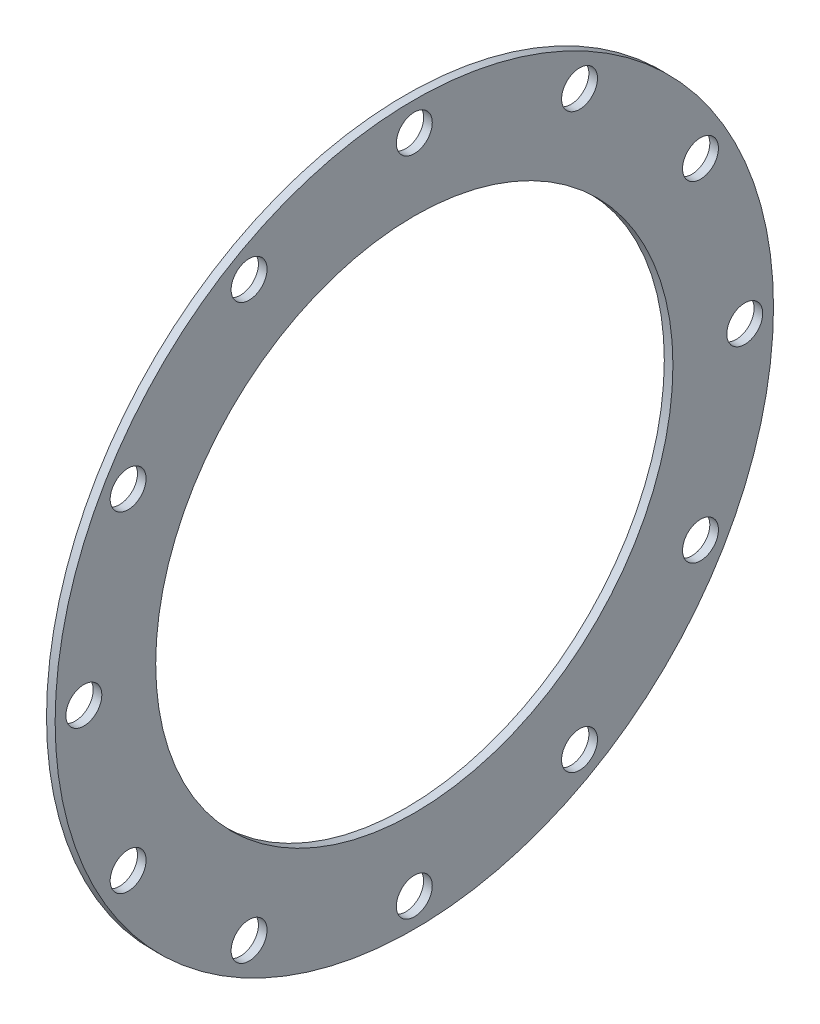
ISO-10303-21;
HEADER;
FILE_DESCRIPTION(('STEP AP214'),'2;1');
FILE_NAME('part.step','',(''),(''),'','','');
FILE_SCHEMA(('AUTOMOTIVE_DESIGN { 1 0 10303 214 1 1 1 1 }'));
ENDSEC;
DATA;
#1=APPLICATION_CONTEXT('core data for automotive mechanical design processes');
#2=APPLICATION_PROTOCOL_DEFINITION('international standard','automotive_design',2000,#1);
#3=PRODUCT_CONTEXT('',#1,'mechanical');
#4=PRODUCT('Part','Part','',(#3));
#5=PRODUCT_RELATED_PRODUCT_CATEGORY('part','',(#4));
#6=PRODUCT_DEFINITION_FORMATION('','',#4);
#7=PRODUCT_DEFINITION_CONTEXT('part definition',#1,'design');
#8=PRODUCT_DEFINITION('design','',#6,#7);
#9=PRODUCT_DEFINITION_SHAPE('','',#8);
#10=(LENGTH_UNIT() NAMED_UNIT(*) SI_UNIT(.MILLI.,.METRE.));
#11=(NAMED_UNIT(*) PLANE_ANGLE_UNIT() SI_UNIT($,.RADIAN.));
#12=(NAMED_UNIT(*) SI_UNIT($,.STERADIAN.) SOLID_ANGLE_UNIT());
#13=UNCERTAINTY_MEASURE_WITH_UNIT(LENGTH_MEASURE(1.E-05),#10,'distance_accuracy_value','');
#14=(GEOMETRIC_REPRESENTATION_CONTEXT(3) GLOBAL_UNCERTAINTY_ASSIGNED_CONTEXT((#13)) GLOBAL_UNIT_ASSIGNED_CONTEXT((#10,
#11,#12)) REPRESENTATION_CONTEXT('',''));
#15=CARTESIAN_POINT('',(0.,0.,0.));
#16=DIRECTION('',(0.,0.,1.));
#17=DIRECTION('',(1.,0.,0.));
#18=AXIS2_PLACEMENT_3D('',#15,#16,#17);
#19=CARTESIAN_POINT('',(60.,0.,0.));
#20=DIRECTION('',(1.,0.,0.));
#21=DIRECTION('',(0.,0.,-1.));
#22=AXIS2_PLACEMENT_3D('',#19,#20,#21);
#23=PLANE('',#22);
#24=CARTESIAN_POINT('',(60.,0.,0.));
#25=DIRECTION('',(1.,0.,0.));
#26=DIRECTION('',(0.,0.,-1.));
#27=AXIS2_PLACEMENT_3D('',#24,#25,#26);
#28=CIRCLE('',#27,1800.);
#29=CARTESIAN_POINT('',(60.,0.,-1800.));
#30=VERTEX_POINT('',#29);
#31=EDGE_CURVE('E148',#30,#30,#28,.T.);
#32=ORIENTED_EDGE('',*,*,#31,.F.);
#33=EDGE_LOOP('',(#32));
#34=FACE_BOUND('',#33,.T.);
#35=CARTESIAN_POINT('',(60.,1149.99999999991,1991.85842870416));
#36=DIRECTION('',(1.,0.,0.));
#37=DIRECTION('',(0.,0.,-1.));
#38=AXIS2_PLACEMENT_3D('',#35,#36,#37);
#39=CIRCLE('',#38,125.000000000099);
#40=CARTESIAN_POINT('',(60.,1149.99999999991,1866.85842870406));
#41=VERTEX_POINT('',#40);
#42=EDGE_CURVE('E128',#41,#41,#39,.T.);
#43=ORIENTED_EDGE('',*,*,#42,.F.);
#44=EDGE_LOOP('',(#43));
#45=FACE_BOUND('',#44,.T.);
#46=CARTESIAN_POINT('',(60.,-1150.00000000009,1991.85842870406));
#47=DIRECTION('',(1.,0.,0.));
#48=DIRECTION('',(0.,0.,-1.));
#49=AXIS2_PLACEMENT_3D('',#46,#47,#48);
#50=CIRCLE('',#49,125.000000000186);
#51=CARTESIAN_POINT('',(60.,-1150.00000000009,1866.85842870388));
#52=VERTEX_POINT('',#51);
#53=EDGE_CURVE('E112',#52,#52,#50,.T.);
#54=ORIENTED_EDGE('',*,*,#53,.F.);
#55=EDGE_LOOP('',(#54));
#56=FACE_BOUND('',#55,.T.);
#57=CARTESIAN_POINT('',(60.,-2300.,-1.95264788778376E-10));
#58=DIRECTION('',(1.,0.,0.));
#59=DIRECTION('',(0.,0.,-1.));
#60=AXIS2_PLACEMENT_3D('',#57,#58,#59);
#61=CIRCLE('',#60,125.000000000202);
#62=CARTESIAN_POINT('',(60.,-2300.,-125.000000000397));
#63=VERTEX_POINT('',#62);
#64=EDGE_CURVE('E96',#63,#63,#61,.T.);
#65=ORIENTED_EDGE('',*,*,#64,.F.);
#66=EDGE_LOOP('',(#65));
#67=FACE_BOUND('',#66,.T.);
#68=CARTESIAN_POINT('',(60.,-1149.99999999992,-1991.85842870436));
#69=DIRECTION('',(1.,0.,0.));
#70=DIRECTION('',(0.,0.,-1.));
#71=AXIS2_PLACEMENT_3D('',#68,#69,#70);
#72=CIRCLE('',#71,125.000000000126);
#73=CARTESIAN_POINT('',(60.,-1149.99999999992,-2116.85842870448));
#74=VERTEX_POINT('',#73);
#75=EDGE_CURVE('E80',#74,#74,#72,.T.);
#76=ORIENTED_EDGE('',*,*,#75,.F.);
#77=EDGE_LOOP('',(#76));
#78=FACE_BOUND('',#77,.T.);
#79=CARTESIAN_POINT('',(60.,1150.00000000008,-1991.85842870426));
#80=DIRECTION('',(1.,0.,0.));
#81=DIRECTION('',(0.,0.,-1.));
#82=AXIS2_PLACEMENT_3D('',#79,#80,#81);
#83=CIRCLE('',#82,125.000000000027);
#84=CARTESIAN_POINT('',(60.,1150.00000000008,-2116.85842870428));
#85=VERTEX_POINT('',#84);
#86=EDGE_CURVE('E64',#85,#85,#83,.T.);
#87=ORIENTED_EDGE('',*,*,#86,.F.);
#88=EDGE_LOOP('',(#87));
#89=FACE_BOUND('',#88,.T.);
#90=CARTESIAN_POINT('',(60.,2300.,0.));
#91=DIRECTION('',(1.,0.,0.));
#92=DIRECTION('',(0.,0.,-1.));
#93=AXIS2_PLACEMENT_3D('',#90,#91,#92);
#94=CIRCLE('',#93,125.);
#95=CARTESIAN_POINT('',(60.,2300.,-125.));
#96=VERTEX_POINT('',#95);
#97=EDGE_CURVE('E50',#96,#96,#94,.T.);
#98=ORIENTED_EDGE('',*,*,#97,.F.);
#99=EDGE_LOOP('',(#98));
#100=FACE_BOUND('',#99,.T.);
#101=CARTESIAN_POINT('',(60.,0.,0.));
#102=DIRECTION('',(1.,0.,0.));
#103=DIRECTION('',(0.,0.,-1.));
#104=AXIS2_PLACEMENT_3D('',#101,#102,#103);
#105=CIRCLE('',#104,2500.);
#106=CARTESIAN_POINT('',(60.,0.,-2500.));
#107=VERTEX_POINT('',#106);
#108=EDGE_CURVE('E10',#107,#107,#105,.T.);
#109=ORIENTED_EDGE('',*,*,#108,.T.);
#110=EDGE_LOOP('',(#109));
#111=FACE_BOUND('',#110,.T.);
#112=CARTESIAN_POINT('',(60.,1991.85842870421,-1150.));
#113=DIRECTION('',(1.,0.,0.));
#114=DIRECTION('',(0.,0.,-1.));
#115=AXIS2_PLACEMENT_3D('',#112,#113,#114);
#116=CIRCLE('',#115,125.);
#117=CARTESIAN_POINT('',(60.,1991.85842870421,-1275.));
#118=VERTEX_POINT('',#117);
#119=EDGE_CURVE('E56',#118,#118,#116,.T.);
#120=ORIENTED_EDGE('',*,*,#119,.F.);
#121=EDGE_LOOP('',(#120));
#122=FACE_BOUND('',#121,.T.);
#123=CARTESIAN_POINT('',(60.,9.7632394389188E-11,-2300.0000000001));
#124=DIRECTION('',(1.,0.,0.));
#125=DIRECTION('',(0.,0.,-1.));
#126=AXIS2_PLACEMENT_3D('',#123,#124,#125);
#127=CIRCLE('',#126,125.000000000072);
#128=CARTESIAN_POINT('',(60.,9.7632394389188E-11,-2425.00000000017));
#129=VERTEX_POINT('',#128);
#130=EDGE_CURVE('E72',#129,#129,#127,.T.);
#131=ORIENTED_EDGE('',*,*,#130,.F.);
#132=EDGE_LOOP('',(#131));
#133=FACE_BOUND('',#132,.T.);
#134=CARTESIAN_POINT('',(60.,-1991.85842870416,-1150.00000000018));
#135=DIRECTION('',(1.,0.,0.));
#136=DIRECTION('',(0.,0.,-1.));
#137=AXIS2_PLACEMENT_3D('',#134,#135,#136);
#138=CIRCLE('',#137,125.000000000173);
#139=CARTESIAN_POINT('',(60.,-1991.85842870416,-1275.00000000036));
#140=VERTEX_POINT('',#139);
#141=EDGE_CURVE('E88',#140,#140,#138,.T.);
#142=ORIENTED_EDGE('',*,*,#141,.F.);
#143=EDGE_LOOP('',(#142));
#144=FACE_BOUND('',#143,.T.);
#145=CARTESIAN_POINT('',(60.,-1991.85842870426,1149.99999999982));
#146=DIRECTION('',(1.,0.,0.));
#147=DIRECTION('',(0.,0.,-1.));
#148=AXIS2_PLACEMENT_3D('',#145,#146,#147);
#149=CIRCLE('',#148,125.000000000208);
#150=CARTESIAN_POINT('',(60.,-1991.85842870426,1024.99999999961));
#151=VERTEX_POINT('',#150);
#152=EDGE_CURVE('E104',#151,#151,#149,.T.);
#153=ORIENTED_EDGE('',*,*,#152,.F.);
#154=EDGE_LOOP('',(#153));
#155=FACE_BOUND('',#154,.T.);
#156=CARTESIAN_POINT('',(60.,-9.79140631529919E-11,2299.9999999999));
#157=DIRECTION('',(1.,0.,0.));
#158=DIRECTION('',(0.,0.,-1.));
#159=AXIS2_PLACEMENT_3D('',#156,#157,#158);
#160=CIRCLE('',#159,125.000000000145);
#161=CARTESIAN_POINT('',(60.,-9.79140631529919E-11,2174.99999999976));
#162=VERTEX_POINT('',#161);
#163=EDGE_CURVE('E120',#162,#162,#160,.T.);
#164=ORIENTED_EDGE('',*,*,#163,.F.);
#165=EDGE_LOOP('',(#164));
#166=FACE_BOUND('',#165,.T.);
#167=CARTESIAN_POINT('',(60.,1991.85842870416,1149.99999999999));
#168=DIRECTION('',(1.,0.,0.));
#169=DIRECTION('',(0.,0.,-1.));
#170=AXIS2_PLACEMENT_3D('',#167,#168,#169);
#171=CIRCLE('',#170,125.000000000056);
#172=CARTESIAN_POINT('',(60.,1991.85842870416,1024.99999999993));
#173=VERTEX_POINT('',#172);
#174=EDGE_CURVE('E136',#173,#173,#171,.T.);
#175=ORIENTED_EDGE('',*,*,#174,.F.);
#176=EDGE_LOOP('',(#175));
#177=FACE_BOUND('',#176,.T.);
#178=ADVANCED_FACE('F37',(#34,#45,#56,#67,#78,#89,#100,#111,#122,#133,#144,#155,#166,#177),#23,.T.);
#179=CARTESIAN_POINT('',(0.,0.,0.));
#180=DIRECTION('',(1.,0.,0.));
#181=DIRECTION('',(0.,0.,-1.));
#182=AXIS2_PLACEMENT_3D('',#179,#180,#181);
#183=PLANE('',#182);
#184=CARTESIAN_POINT('',(0.,0.,0.));
#185=DIRECTION('',(1.,0.,0.));
#186=DIRECTION('',(0.,0.,-1.));
#187=AXIS2_PLACEMENT_3D('',#184,#185,#186);
#188=CIRCLE('',#187,1800.);
#189=CARTESIAN_POINT('',(0.,0.,-1800.));
#190=VERTEX_POINT('',#189);
#191=EDGE_CURVE('E144',#190,#190,#188,.T.);
#192=ORIENTED_EDGE('',*,*,#191,.T.);
#193=EDGE_LOOP('',(#192));
#194=FACE_BOUND('',#193,.T.);
#195=CARTESIAN_POINT('',(0.,0.,0.));
#196=DIRECTION('',(1.,0.,0.));
#197=DIRECTION('',(0.,0.,-1.));
#198=AXIS2_PLACEMENT_3D('',#195,#196,#197);
#199=CIRCLE('',#198,2500.);
#200=CARTESIAN_POINT('',(0.,0.,-2500.));
#201=VERTEX_POINT('',#200);
#202=EDGE_CURVE('E41',#201,#201,#199,.T.);
#203=ORIENTED_EDGE('',*,*,#202,.F.);
#204=EDGE_LOOP('',(#203));
#205=FACE_BOUND('',#204,.T.);
#206=CARTESIAN_POINT('',(0.,2300.,0.));
#207=DIRECTION('',(1.,0.,0.));
#208=DIRECTION('',(0.,0.,-1.));
#209=AXIS2_PLACEMENT_3D('',#206,#207,#208);
#210=CIRCLE('',#209,125.);
#211=CARTESIAN_POINT('',(0.,2300.,-125.));
#212=VERTEX_POINT('',#211);
#213=EDGE_CURVE('E52',#212,#212,#210,.T.);
#214=ORIENTED_EDGE('',*,*,#213,.T.);
#215=EDGE_LOOP('',(#214));
#216=FACE_BOUND('',#215,.T.);
#217=CARTESIAN_POINT('',(0.,1991.85842870421,-1150.));
#218=DIRECTION('',(1.,0.,0.));
#219=DIRECTION('',(0.,0.,-1.));
#220=AXIS2_PLACEMENT_3D('',#217,#218,#219);
#221=CIRCLE('',#220,125.);
#222=CARTESIAN_POINT('',(0.,1991.85842870421,-1275.));
#223=VERTEX_POINT('',#222);
#224=EDGE_CURVE('E60',#223,#223,#221,.T.);
#225=ORIENTED_EDGE('',*,*,#224,.T.);
#226=EDGE_LOOP('',(#225));
#227=FACE_BOUND('',#226,.T.);
#228=CARTESIAN_POINT('',(0.,1150.00000000008,-1991.85842870426));
#229=DIRECTION('',(1.,0.,0.));
#230=DIRECTION('',(0.,0.,-1.));
#231=AXIS2_PLACEMENT_3D('',#228,#229,#230);
#232=CIRCLE('',#231,125.000000000027);
#233=CARTESIAN_POINT('',(0.,1150.00000000008,-2116.85842870428));
#234=VERTEX_POINT('',#233);
#235=EDGE_CURVE('E68',#234,#234,#232,.T.);
#236=ORIENTED_EDGE('',*,*,#235,.T.);
#237=EDGE_LOOP('',(#236));
#238=FACE_BOUND('',#237,.T.);
#239=CARTESIAN_POINT('',(0.,9.7632394389188E-11,-2300.0000000001));
#240=DIRECTION('',(1.,0.,0.));
#241=DIRECTION('',(0.,0.,-1.));
#242=AXIS2_PLACEMENT_3D('',#239,#240,#241);
#243=CIRCLE('',#242,125.000000000072);
#244=CARTESIAN_POINT('',(0.,9.7632394389188E-11,-2425.00000000017));
#245=VERTEX_POINT('',#244);
#246=EDGE_CURVE('E76',#245,#245,#243,.T.);
#247=ORIENTED_EDGE('',*,*,#246,.T.);
#248=EDGE_LOOP('',(#247));
#249=FACE_BOUND('',#248,.T.);
#250=CARTESIAN_POINT('',(0.,-1149.99999999992,-1991.85842870436));
#251=DIRECTION('',(1.,0.,0.));
#252=DIRECTION('',(0.,0.,-1.));
#253=AXIS2_PLACEMENT_3D('',#250,#251,#252);
#254=CIRCLE('',#253,125.000000000126);
#255=CARTESIAN_POINT('',(0.,-1149.99999999992,-2116.85842870448));
#256=VERTEX_POINT('',#255);
#257=EDGE_CURVE('E84',#256,#256,#254,.T.);
#258=ORIENTED_EDGE('',*,*,#257,.T.);
#259=EDGE_LOOP('',(#258));
#260=FACE_BOUND('',#259,.T.);
#261=CARTESIAN_POINT('',(0.,-1991.85842870416,-1150.00000000018));
#262=DIRECTION('',(1.,0.,0.));
#263=DIRECTION('',(0.,0.,-1.));
#264=AXIS2_PLACEMENT_3D('',#261,#262,#263);
#265=CIRCLE('',#264,125.000000000173);
#266=CARTESIAN_POINT('',(0.,-1991.85842870416,-1275.00000000036));
#267=VERTEX_POINT('',#266);
#268=EDGE_CURVE('E92',#267,#267,#265,.T.);
#269=ORIENTED_EDGE('',*,*,#268,.T.);
#270=EDGE_LOOP('',(#269));
#271=FACE_BOUND('',#270,.T.);
#272=CARTESIAN_POINT('',(0.,-2300.,-1.95264788778376E-10));
#273=DIRECTION('',(1.,0.,0.));
#274=DIRECTION('',(0.,0.,-1.));
#275=AXIS2_PLACEMENT_3D('',#272,#273,#274);
#276=CIRCLE('',#275,125.000000000202);
#277=CARTESIAN_POINT('',(0.,-2300.,-125.000000000397));
#278=VERTEX_POINT('',#277);
#279=EDGE_CURVE('E100',#278,#278,#276,.T.);
#280=ORIENTED_EDGE('',*,*,#279,.T.);
#281=EDGE_LOOP('',(#280));
#282=FACE_BOUND('',#281,.T.);
#283=CARTESIAN_POINT('',(0.,-1991.85842870426,1149.99999999982));
#284=DIRECTION('',(1.,0.,0.));
#285=DIRECTION('',(0.,0.,-1.));
#286=AXIS2_PLACEMENT_3D('',#283,#284,#285);
#287=CIRCLE('',#286,125.000000000208);
#288=CARTESIAN_POINT('',(0.,-1991.85842870426,1024.99999999961));
#289=VERTEX_POINT('',#288);
#290=EDGE_CURVE('E108',#289,#289,#287,.T.);
#291=ORIENTED_EDGE('',*,*,#290,.T.);
#292=EDGE_LOOP('',(#291));
#293=FACE_BOUND('',#292,.T.);
#294=CARTESIAN_POINT('',(0.,-1150.00000000009,1991.85842870406));
#295=DIRECTION('',(1.,0.,0.));
#296=DIRECTION('',(0.,0.,-1.));
#297=AXIS2_PLACEMENT_3D('',#294,#295,#296);
#298=CIRCLE('',#297,125.000000000186);
#299=CARTESIAN_POINT('',(0.,-1150.00000000009,1866.85842870388));
#300=VERTEX_POINT('',#299);
#301=EDGE_CURVE('E116',#300,#300,#298,.T.);
#302=ORIENTED_EDGE('',*,*,#301,.T.);
#303=EDGE_LOOP('',(#302));
#304=FACE_BOUND('',#303,.T.);
#305=CARTESIAN_POINT('',(0.,-9.79140631529919E-11,2299.9999999999));
#306=DIRECTION('',(1.,0.,0.));
#307=DIRECTION('',(0.,0.,-1.));
#308=AXIS2_PLACEMENT_3D('',#305,#306,#307);
#309=CIRCLE('',#308,125.000000000145);
#310=CARTESIAN_POINT('',(0.,-9.79140631529919E-11,2174.99999999976));
#311=VERTEX_POINT('',#310);
#312=EDGE_CURVE('E124',#311,#311,#309,.T.);
#313=ORIENTED_EDGE('',*,*,#312,.T.);
#314=EDGE_LOOP('',(#313));
#315=FACE_BOUND('',#314,.T.);
#316=CARTESIAN_POINT('',(0.,1149.99999999991,1991.85842870416));
#317=DIRECTION('',(1.,0.,0.));
#318=DIRECTION('',(0.,0.,-1.));
#319=AXIS2_PLACEMENT_3D('',#316,#317,#318);
#320=CIRCLE('',#319,125.000000000099);
#321=CARTESIAN_POINT('',(0.,1149.99999999991,1866.85842870406));
#322=VERTEX_POINT('',#321);
#323=EDGE_CURVE('E132',#322,#322,#320,.T.);
#324=ORIENTED_EDGE('',*,*,#323,.T.);
#325=EDGE_LOOP('',(#324));
#326=FACE_BOUND('',#325,.T.);
#327=CARTESIAN_POINT('',(0.,1991.85842870416,1149.99999999999));
#328=DIRECTION('',(1.,0.,0.));
#329=DIRECTION('',(0.,0.,-1.));
#330=AXIS2_PLACEMENT_3D('',#327,#328,#329);
#331=CIRCLE('',#330,125.000000000056);
#332=CARTESIAN_POINT('',(0.,1991.85842870416,1024.99999999993));
#333=VERTEX_POINT('',#332);
#334=EDGE_CURVE('E140',#333,#333,#331,.T.);
#335=ORIENTED_EDGE('',*,*,#334,.T.);
#336=EDGE_LOOP('',(#335));
#337=FACE_BOUND('',#336,.T.);
#338=ADVANCED_FACE('F156',(#194,#205,#216,#227,#238,#249,#260,#271,#282,#293,#304,#315,#326,
#337),#183,.F.);
#339=CARTESIAN_POINT('',(60.,0.,0.));
#340=DIRECTION('',(-1.,0.,0.));
#341=DIRECTION('',(0.,0.,1.));
#342=AXIS2_PLACEMENT_3D('',#339,#340,#341);
#343=CYLINDRICAL_SURFACE('',#342,2500.);
#344=ORIENTED_EDGE('',*,*,#108,.F.);
#345=EDGE_LOOP('',(#344));
#346=FACE_BOUND('',#345,.T.);
#347=ORIENTED_EDGE('',*,*,#202,.T.);
#348=EDGE_LOOP('',(#347));
#349=FACE_BOUND('',#348,.T.);
#350=ADVANCED_FACE('F39',(#346,#349),#343,.T.);
#351=CARTESIAN_POINT('',(60.,2300.,0.));
#352=DIRECTION('',(-1.,0.,0.));
#353=DIRECTION('',(0.,0.,1.));
#354=AXIS2_PLACEMENT_3D('',#351,#352,#353);
#355=CYLINDRICAL_SURFACE('',#354,125.);
#356=ORIENTED_EDGE('',*,*,#97,.T.);
#357=EDGE_LOOP('',(#356));
#358=FACE_BOUND('',#357,.T.);
#359=ORIENTED_EDGE('',*,*,#213,.F.);
#360=EDGE_LOOP('',(#359));
#361=FACE_BOUND('',#360,.T.);
#362=ADVANCED_FACE('F204',(#358,#361),#355,.F.);
#363=CARTESIAN_POINT('',(60.,1991.85842870421,-1150.));
#364=DIRECTION('',(-1.,0.,0.));
#365=DIRECTION('',(0.,0.,1.));
#366=AXIS2_PLACEMENT_3D('',#363,#364,#365);
#367=CYLINDRICAL_SURFACE('',#366,125.);
#368=ORIENTED_EDGE('',*,*,#119,.T.);
#369=EDGE_LOOP('',(#368));
#370=FACE_BOUND('',#369,.T.);
#371=ORIENTED_EDGE('',*,*,#224,.F.);
#372=EDGE_LOOP('',(#371));
#373=FACE_BOUND('',#372,.T.);
#374=ADVANCED_FACE('F209',(#370,#373),#367,.F.);
#375=CARTESIAN_POINT('',(60.,1150.00000000008,-1991.85842870426));
#376=DIRECTION('',(-1.,0.,0.));
#377=DIRECTION('',(0.,0.,1.));
#378=AXIS2_PLACEMENT_3D('',#375,#376,#377);
#379=CYLINDRICAL_SURFACE('',#378,125.000000000027);
#380=ORIENTED_EDGE('',*,*,#86,.T.);
#381=EDGE_LOOP('',(#380));
#382=FACE_BOUND('',#381,.T.);
#383=ORIENTED_EDGE('',*,*,#235,.F.);
#384=EDGE_LOOP('',(#383));
#385=FACE_BOUND('',#384,.T.);
#386=ADVANCED_FACE('F213',(#382,#385),#379,.F.);
#387=CARTESIAN_POINT('',(60.,9.7632394389188E-11,-2300.0000000001));
#388=DIRECTION('',(-1.,0.,0.));
#389=DIRECTION('',(0.,0.,1.));
#390=AXIS2_PLACEMENT_3D('',#387,#388,#389);
#391=CYLINDRICAL_SURFACE('',#390,125.000000000072);
#392=ORIENTED_EDGE('',*,*,#130,.T.);
#393=EDGE_LOOP('',(#392));
#394=FACE_BOUND('',#393,.T.);
#395=ORIENTED_EDGE('',*,*,#246,.F.);
#396=EDGE_LOOP('',(#395));
#397=FACE_BOUND('',#396,.T.);
#398=ADVANCED_FACE('F217',(#394,#397),#391,.F.);
#399=CARTESIAN_POINT('',(60.,-1149.99999999992,-1991.85842870436));
#400=DIRECTION('',(-1.,0.,0.));
#401=DIRECTION('',(0.,0.,1.));
#402=AXIS2_PLACEMENT_3D('',#399,#400,#401);
#403=CYLINDRICAL_SURFACE('',#402,125.000000000126);
#404=ORIENTED_EDGE('',*,*,#75,.T.);
#405=EDGE_LOOP('',(#404));
#406=FACE_BOUND('',#405,.T.);
#407=ORIENTED_EDGE('',*,*,#257,.F.);
#408=EDGE_LOOP('',(#407));
#409=FACE_BOUND('',#408,.T.);
#410=ADVANCED_FACE('F221',(#406,#409),#403,.F.);
#411=CARTESIAN_POINT('',(60.,-1991.85842870416,-1150.00000000018));
#412=DIRECTION('',(-1.,0.,0.));
#413=DIRECTION('',(0.,0.,1.));
#414=AXIS2_PLACEMENT_3D('',#411,#412,#413);
#415=CYLINDRICAL_SURFACE('',#414,125.000000000173);
#416=ORIENTED_EDGE('',*,*,#141,.T.);
#417=EDGE_LOOP('',(#416));
#418=FACE_BOUND('',#417,.T.);
#419=ORIENTED_EDGE('',*,*,#268,.F.);
#420=EDGE_LOOP('',(#419));
#421=FACE_BOUND('',#420,.T.);
#422=ADVANCED_FACE('F225',(#418,#421),#415,.F.);
#423=CARTESIAN_POINT('',(60.,-2300.,-1.95264788778376E-10));
#424=DIRECTION('',(-1.,0.,0.));
#425=DIRECTION('',(0.,0.,1.));
#426=AXIS2_PLACEMENT_3D('',#423,#424,#425);
#427=CYLINDRICAL_SURFACE('',#426,125.000000000202);
#428=ORIENTED_EDGE('',*,*,#64,.T.);
#429=EDGE_LOOP('',(#428));
#430=FACE_BOUND('',#429,.T.);
#431=ORIENTED_EDGE('',*,*,#279,.F.);
#432=EDGE_LOOP('',(#431));
#433=FACE_BOUND('',#432,.T.);
#434=ADVANCED_FACE('F229',(#430,#433),#427,.F.);
#435=CARTESIAN_POINT('',(60.,-1991.85842870426,1149.99999999982));
#436=DIRECTION('',(-1.,0.,0.));
#437=DIRECTION('',(0.,0.,1.));
#438=AXIS2_PLACEMENT_3D('',#435,#436,#437);
#439=CYLINDRICAL_SURFACE('',#438,125.000000000208);
#440=ORIENTED_EDGE('',*,*,#152,.T.);
#441=EDGE_LOOP('',(#440));
#442=FACE_BOUND('',#441,.T.);
#443=ORIENTED_EDGE('',*,*,#290,.F.);
#444=EDGE_LOOP('',(#443));
#445=FACE_BOUND('',#444,.T.);
#446=ADVANCED_FACE('F233',(#442,#445),#439,.F.);
#447=CARTESIAN_POINT('',(60.,-1150.00000000009,1991.85842870406));
#448=DIRECTION('',(-1.,0.,0.));
#449=DIRECTION('',(0.,0.,1.));
#450=AXIS2_PLACEMENT_3D('',#447,#448,#449);
#451=CYLINDRICAL_SURFACE('',#450,125.000000000186);
#452=ORIENTED_EDGE('',*,*,#53,.T.);
#453=EDGE_LOOP('',(#452));
#454=FACE_BOUND('',#453,.T.);
#455=ORIENTED_EDGE('',*,*,#301,.F.);
#456=EDGE_LOOP('',(#455));
#457=FACE_BOUND('',#456,.T.);
#458=ADVANCED_FACE('F237',(#454,#457),#451,.F.);
#459=CARTESIAN_POINT('',(60.,-9.79140631529919E-11,2299.9999999999));
#460=DIRECTION('',(-1.,0.,0.));
#461=DIRECTION('',(0.,0.,1.));
#462=AXIS2_PLACEMENT_3D('',#459,#460,#461);
#463=CYLINDRICAL_SURFACE('',#462,125.000000000145);
#464=ORIENTED_EDGE('',*,*,#163,.T.);
#465=EDGE_LOOP('',(#464));
#466=FACE_BOUND('',#465,.T.);
#467=ORIENTED_EDGE('',*,*,#312,.F.);
#468=EDGE_LOOP('',(#467));
#469=FACE_BOUND('',#468,.T.);
#470=ADVANCED_FACE('F241',(#466,#469),#463,.F.);
#471=CARTESIAN_POINT('',(60.,1149.99999999991,1991.85842870416));
#472=DIRECTION('',(-1.,0.,0.));
#473=DIRECTION('',(0.,0.,1.));
#474=AXIS2_PLACEMENT_3D('',#471,#472,#473);
#475=CYLINDRICAL_SURFACE('',#474,125.000000000099);
#476=ORIENTED_EDGE('',*,*,#42,.T.);
#477=EDGE_LOOP('',(#476));
#478=FACE_BOUND('',#477,.T.);
#479=ORIENTED_EDGE('',*,*,#323,.F.);
#480=EDGE_LOOP('',(#479));
#481=FACE_BOUND('',#480,.T.);
#482=ADVANCED_FACE('F195',(#478,#481),#475,.F.);
#483=CARTESIAN_POINT('',(60.,1991.85842870416,1149.99999999999));
#484=DIRECTION('',(-1.,0.,0.));
#485=DIRECTION('',(0.,0.,1.));
#486=AXIS2_PLACEMENT_3D('',#483,#484,#485);
#487=CYLINDRICAL_SURFACE('',#486,125.000000000056);
#488=ORIENTED_EDGE('',*,*,#174,.T.);
#489=EDGE_LOOP('',(#488));
#490=FACE_BOUND('',#489,.T.);
#491=ORIENTED_EDGE('',*,*,#334,.F.);
#492=EDGE_LOOP('',(#491));
#493=FACE_BOUND('',#492,.T.);
#494=ADVANCED_FACE('F162',(#490,#493),#487,.F.);
#495=CARTESIAN_POINT('',(0.,0.,0.));
#496=DIRECTION('',(1.,0.,0.));
#497=DIRECTION('',(0.,0.,-1.));
#498=AXIS2_PLACEMENT_3D('',#495,#496,#497);
#499=CYLINDRICAL_SURFACE('',#498,1800.);
#500=ORIENTED_EDGE('',*,*,#191,.F.);
#501=EDGE_LOOP('',(#500));
#502=FACE_BOUND('',#501,.T.);
#503=ORIENTED_EDGE('',*,*,#31,.T.);
#504=EDGE_LOOP('',(#503));
#505=FACE_BOUND('',#504,.T.);
#506=ADVANCED_FACE('F159',(#502,#505),#499,.F.);
#507=CLOSED_SHELL('',(#178,#338,#350,#362,#374,#386,#398,#410,#422,#434,#446,#458,#470,#482,
#494,#506));
#508=MANIFOLD_SOLID_BREP('B2',#507);
#509=ADVANCED_BREP_SHAPE_REPRESENTATION('',(#18,#508),#14);
#510=SHAPE_DEFINITION_REPRESENTATION(#9,#509);
ENDSEC;
END-ISO-10303-21;
